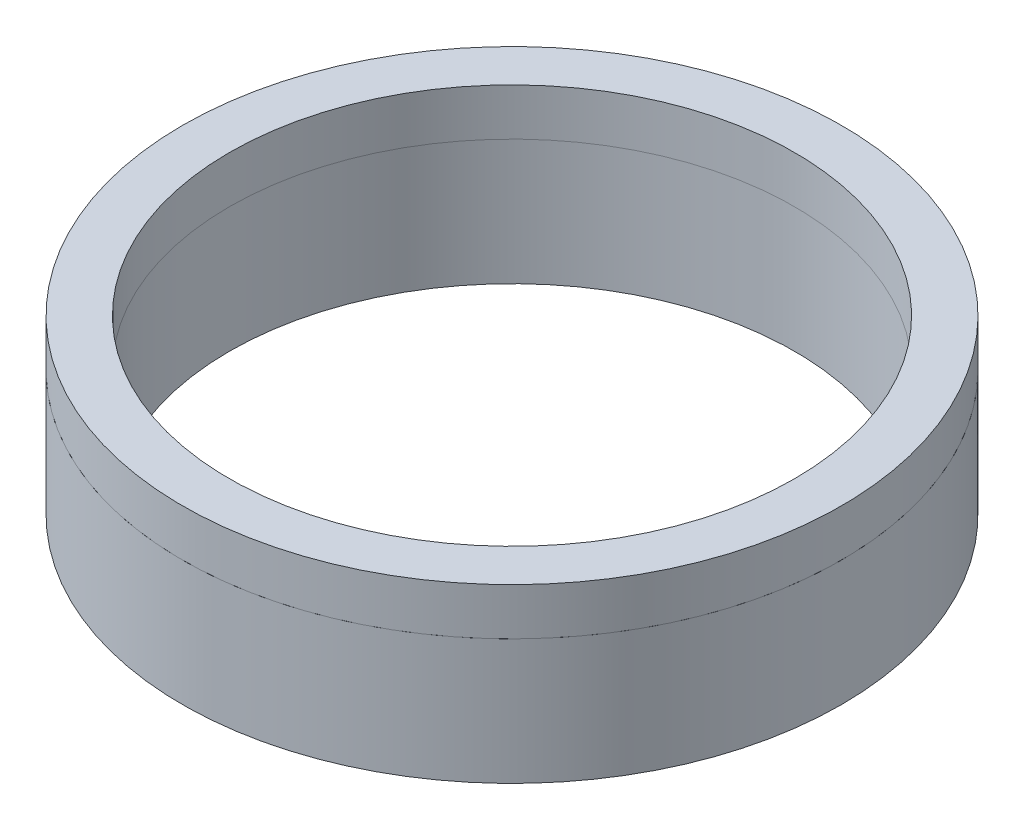
ISO-10303-21;
HEADER;
FILE_DESCRIPTION(('STEP AP214'),'2;1');
FILE_NAME('part.step','',(''),(''),'','','');
FILE_SCHEMA(('AUTOMOTIVE_DESIGN { 1 0 10303 214 1 1 1 1 }'));
ENDSEC;
DATA;
#1=APPLICATION_CONTEXT('core data for automotive mechanical design processes');
#2=APPLICATION_PROTOCOL_DEFINITION('international standard','automotive_design',2000,#1);
#3=PRODUCT_CONTEXT('',#1,'mechanical');
#4=PRODUCT('Part','Part','',(#3));
#5=PRODUCT_RELATED_PRODUCT_CATEGORY('part','',(#4));
#6=PRODUCT_DEFINITION_FORMATION('','',#4);
#7=PRODUCT_DEFINITION_CONTEXT('part definition',#1,'design');
#8=PRODUCT_DEFINITION('design','',#6,#7);
#9=PRODUCT_DEFINITION_SHAPE('','',#8);
#10=(LENGTH_UNIT() NAMED_UNIT(*) SI_UNIT(.MILLI.,.METRE.));
#11=(NAMED_UNIT(*) PLANE_ANGLE_UNIT() SI_UNIT($,.RADIAN.));
#12=(NAMED_UNIT(*) SI_UNIT($,.STERADIAN.) SOLID_ANGLE_UNIT());
#13=UNCERTAINTY_MEASURE_WITH_UNIT(LENGTH_MEASURE(1.E-05),#10,'distance_accuracy_value','');
#14=(GEOMETRIC_REPRESENTATION_CONTEXT(3) GLOBAL_UNCERTAINTY_ASSIGNED_CONTEXT((#13)) GLOBAL_UNIT_ASSIGNED_CONTEXT((#10,
#11,#12)) REPRESENTATION_CONTEXT('',''));
#15=CARTESIAN_POINT('',(0.,0.,0.));
#16=DIRECTION('',(0.,0.,1.));
#17=DIRECTION('',(1.,0.,0.));
#18=AXIS2_PLACEMENT_3D('',#15,#16,#17);
#19=CARTESIAN_POINT('',(0.,11.,0.));
#20=DIRECTION('',(0.,1.,0.));
#21=DIRECTION('',(-1.,0.,0.));
#22=AXIS2_PLACEMENT_3D('',#19,#20,#21);
#23=PLANE('',#22);
#24=CARTESIAN_POINT('',(0.,11.,0.));
#25=DIRECTION('',(0.,1.,0.));
#26=DIRECTION('',(-1.,0.,0.));
#27=AXIS2_PLACEMENT_3D('',#24,#25,#26);
#28=CIRCLE('',#27,21.055);
#29=CARTESIAN_POINT('',(-21.055,11.,0.));
#30=VERTEX_POINT('',#29);
#31=EDGE_CURVE('E11',#30,#30,#28,.T.);
#32=ORIENTED_EDGE('',*,*,#31,.T.);
#33=EDGE_LOOP('',(#32));
#34=FACE_BOUND('',#33,.T.);
#35=CARTESIAN_POINT('',(0.,11.,0.));
#36=DIRECTION('',(0.,1.,0.));
#37=DIRECTION('',(-1.,0.,0.));
#38=AXIS2_PLACEMENT_3D('',#35,#36,#37);
#39=CIRCLE('',#38,18.055);
#40=CARTESIAN_POINT('',(-18.055,11.,0.));
#41=VERTEX_POINT('',#40);
#42=EDGE_CURVE('E53',#41,#41,#39,.T.);
#43=ORIENTED_EDGE('',*,*,#42,.F.);
#44=EDGE_LOOP('',(#43));
#45=FACE_BOUND('',#44,.T.);
#46=ADVANCED_FACE('F42',(#34,#45),#23,.T.);
#47=CARTESIAN_POINT('',(0.,8.,0.));
#48=DIRECTION('',(0.,1.,0.));
#49=DIRECTION('',(-1.,0.,0.));
#50=AXIS2_PLACEMENT_3D('',#47,#48,#49);
#51=PLANE('',#50);
#52=CARTESIAN_POINT('',(0.,8.,0.));
#53=DIRECTION('',(0.,1.,0.));
#54=DIRECTION('',(-1.,0.,0.));
#55=AXIS2_PLACEMENT_3D('',#52,#53,#54);
#56=CIRCLE('',#55,21.055);
#57=CARTESIAN_POINT('',(-21.055,8.,0.));
#58=VERTEX_POINT('',#57);
#59=EDGE_CURVE('E46',#58,#58,#56,.T.);
#60=ORIENTED_EDGE('',*,*,#59,.F.);
#61=EDGE_LOOP('',(#60));
#62=FACE_BOUND('',#61,.T.);
#63=CARTESIAN_POINT('',(0.,8.,0.));
#64=DIRECTION('',(0.,1.,0.));
#65=DIRECTION('',(-1.,0.,0.));
#66=AXIS2_PLACEMENT_3D('',#63,#64,#65);
#67=CIRCLE('',#66,18.055);
#68=CARTESIAN_POINT('',(-18.055,8.,0.));
#69=VERTEX_POINT('',#68);
#70=EDGE_CURVE('E55',#69,#69,#67,.T.);
#71=ORIENTED_EDGE('',*,*,#70,.T.);
#72=EDGE_LOOP('',(#71));
#73=FACE_BOUND('',#72,.T.);
#74=ADVANCED_FACE('F65',(#62,#73),#51,.F.);
#75=CARTESIAN_POINT('',(0.,11.,0.));
#76=DIRECTION('',(0.,-1.,0.));
#77=DIRECTION('',(1.,0.,0.));
#78=AXIS2_PLACEMENT_3D('',#75,#76,#77);
#79=CYLINDRICAL_SURFACE('',#78,21.055);
#80=ORIENTED_EDGE('',*,*,#31,.F.);
#81=EDGE_LOOP('',(#80));
#82=FACE_BOUND('',#81,.T.);
#83=ORIENTED_EDGE('',*,*,#59,.T.);
#84=EDGE_LOOP('',(#83));
#85=FACE_BOUND('',#84,.T.);
#86=ADVANCED_FACE('F44',(#82,#85),#79,.T.);
#87=CARTESIAN_POINT('',(0.,11.,0.));
#88=DIRECTION('',(0.,-1.,0.));
#89=DIRECTION('',(1.,0.,0.));
#90=AXIS2_PLACEMENT_3D('',#87,#88,#89);
#91=CYLINDRICAL_SURFACE('',#90,18.055);
#92=ORIENTED_EDGE('',*,*,#42,.T.);
#93=EDGE_LOOP('',(#92));
#94=FACE_BOUND('',#93,.T.);
#95=ORIENTED_EDGE('',*,*,#70,.F.);
#96=EDGE_LOOP('',(#95));
#97=FACE_BOUND('',#96,.T.);
#98=ADVANCED_FACE('F61',(#94,#97),#91,.F.);
#99=CLOSED_SHELL('',(#46,#74,#86,#98));
#100=MANIFOLD_SOLID_BREP('B2',#99);
#101=CARTESIAN_POINT('',(0.,0.,0.));
#102=DIRECTION('',(0.,-1.,0.));
#103=DIRECTION('',(1.,0.,0.));
#104=AXIS2_PLACEMENT_3D('',#101,#102,#103);
#105=CYLINDRICAL_SURFACE('',#104,18.055);
#106=CARTESIAN_POINT('',(0.,0.,0.));
#107=DIRECTION('',(0.,-1.,0.));
#108=DIRECTION('',(1.,0.,0.));
#109=AXIS2_PLACEMENT_3D('',#106,#107,#108);
#110=CIRCLE('',#109,18.055);
#111=CARTESIAN_POINT('',(18.055,0.,0.));
#112=VERTEX_POINT('',#111);
#113=EDGE_CURVE('E119',#112,#112,#110,.T.);
#114=ORIENTED_EDGE('',*,*,#113,.T.);
#115=EDGE_LOOP('',(#114));
#116=FACE_BOUND('',#115,.T.);
#117=CARTESIAN_POINT('',(0.,8.,0.));
#118=DIRECTION('',(0.,-1.,0.));
#119=DIRECTION('',(1.,0.,0.));
#120=AXIS2_PLACEMENT_3D('',#117,#118,#119);
#121=CIRCLE('',#120,18.055);
#122=CARTESIAN_POINT('',(18.055,8.,0.));
#123=VERTEX_POINT('',#122);
#124=EDGE_CURVE('E41',#123,#123,#121,.T.);
#125=ORIENTED_EDGE('',*,*,#124,.F.);
#126=EDGE_LOOP('',(#125));
#127=FACE_BOUND('',#126,.T.);
#128=ADVANCED_FACE('F105',(#116,#127),#105,.F.);
#129=CARTESIAN_POINT('',(18.055,8.,0.));
#130=DIRECTION('',(0.,1.,0.));
#131=DIRECTION('',(-1.,0.,0.));
#132=AXIS2_PLACEMENT_3D('',#129,#130,#131);
#133=PLANE('',#132);
#134=ORIENTED_EDGE('',*,*,#124,.T.);
#135=EDGE_LOOP('',(#134));
#136=FACE_BOUND('',#135,.T.);
#137=CARTESIAN_POINT('',(0.,8.,0.));
#138=DIRECTION('',(0.,-1.,0.));
#139=DIRECTION('',(1.,0.,0.));
#140=AXIS2_PLACEMENT_3D('',#137,#138,#139);
#141=CIRCLE('',#140,21.055);
#142=CARTESIAN_POINT('',(21.055,8.,0.));
#143=VERTEX_POINT('',#142);
#144=EDGE_CURVE('E111',#143,#143,#141,.T.);
#145=ORIENTED_EDGE('',*,*,#144,.F.);
#146=EDGE_LOOP('',(#145));
#147=FACE_BOUND('',#146,.T.);
#148=ADVANCED_FACE('F135',(#136,#147),#133,.T.);
#149=CARTESIAN_POINT('',(0.,0.,0.));
#150=DIRECTION('',(0.,-1.,0.));
#151=DIRECTION('',(1.,0.,0.));
#152=AXIS2_PLACEMENT_3D('',#149,#150,#151);
#153=CYLINDRICAL_SURFACE('',#152,21.055);
#154=ORIENTED_EDGE('',*,*,#144,.T.);
#155=EDGE_LOOP('',(#154));
#156=FACE_BOUND('',#155,.T.);
#157=CARTESIAN_POINT('',(0.,0.,0.));
#158=DIRECTION('',(0.,-1.,0.));
#159=DIRECTION('',(1.,0.,0.));
#160=AXIS2_PLACEMENT_3D('',#157,#158,#159);
#161=CIRCLE('',#160,21.055);
#162=CARTESIAN_POINT('',(21.055,0.,0.));
#163=VERTEX_POINT('',#162);
#164=EDGE_CURVE('E115',#163,#163,#161,.T.);
#165=ORIENTED_EDGE('',*,*,#164,.F.);
#166=EDGE_LOOP('',(#165));
#167=FACE_BOUND('',#166,.T.);
#168=ADVANCED_FACE('F129',(#156,#167),#153,.T.);
#169=CARTESIAN_POINT('',(18.055,0.,0.));
#170=DIRECTION('',(0.,-1.,0.));
#171=DIRECTION('',(1.,0.,0.));
#172=AXIS2_PLACEMENT_3D('',#169,#170,#171);
#173=PLANE('',#172);
#174=ORIENTED_EDGE('',*,*,#164,.T.);
#175=EDGE_LOOP('',(#174));
#176=FACE_BOUND('',#175,.T.);
#177=ORIENTED_EDGE('',*,*,#113,.F.);
#178=EDGE_LOOP('',(#177));
#179=FACE_BOUND('',#178,.T.);
#180=ADVANCED_FACE('F127',(#176,#179),#173,.T.);
#181=CLOSED_SHELL('',(#128,#148,#168,#180));
#182=MANIFOLD_SOLID_BREP('B6',#181);
#183=ADVANCED_BREP_SHAPE_REPRESENTATION('',(#18,#100,#182),#14);
#184=SHAPE_DEFINITION_REPRESENTATION(#9,#183);
ENDSEC;
END-ISO-10303-21;
